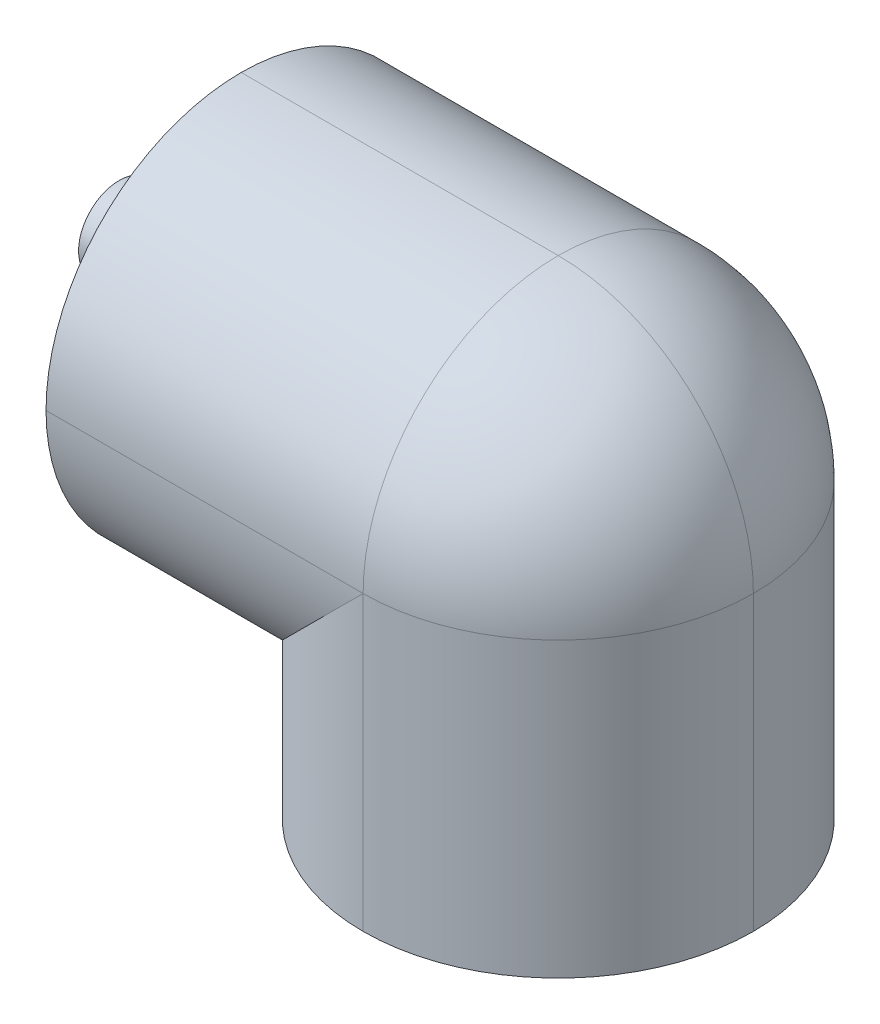
ISO-10303-21;
HEADER;
FILE_DESCRIPTION(('STEP AP214'),'2;1');
FILE_NAME('part.step','',(''),(''),'','','');
FILE_SCHEMA(('AUTOMOTIVE_DESIGN { 1 0 10303 214 1 1 1 1 }'));
ENDSEC;
DATA;
#1=APPLICATION_CONTEXT('core data for automotive mechanical design processes');
#2=APPLICATION_PROTOCOL_DEFINITION('international standard','automotive_design',2000,#1);
#3=PRODUCT_CONTEXT('',#1,'mechanical');
#4=PRODUCT('Part','Part','',(#3));
#5=PRODUCT_RELATED_PRODUCT_CATEGORY('part','',(#4));
#6=PRODUCT_DEFINITION_FORMATION('','',#4);
#7=PRODUCT_DEFINITION_CONTEXT('part definition',#1,'design');
#8=PRODUCT_DEFINITION('design','',#6,#7);
#9=PRODUCT_DEFINITION_SHAPE('','',#8);
#10=(LENGTH_UNIT() NAMED_UNIT(*) SI_UNIT(.MILLI.,.METRE.));
#11=(NAMED_UNIT(*) PLANE_ANGLE_UNIT() SI_UNIT($,.RADIAN.));
#12=(NAMED_UNIT(*) SI_UNIT($,.STERADIAN.) SOLID_ANGLE_UNIT());
#13=UNCERTAINTY_MEASURE_WITH_UNIT(LENGTH_MEASURE(1.E-05),#10,'distance_accuracy_value','');
#14=(GEOMETRIC_REPRESENTATION_CONTEXT(3) GLOBAL_UNCERTAINTY_ASSIGNED_CONTEXT((#13)) GLOBAL_UNIT_ASSIGNED_CONTEXT((#10,
#11,#12)) REPRESENTATION_CONTEXT('',''));
#15=CARTESIAN_POINT('',(0.,0.,0.));
#16=DIRECTION('',(0.,0.,1.));
#17=DIRECTION('',(1.,0.,0.));
#18=AXIS2_PLACEMENT_3D('',#15,#16,#17);
#19=CARTESIAN_POINT('',(0.,-30.,0.));
#20=DIRECTION('',(0.,-1.,0.));
#21=DIRECTION('',(0.,0.,-1.));
#22=AXIS2_PLACEMENT_3D('',#19,#20,#21);
#23=PLANE('',#22);
#24=CARTESIAN_POINT('',(24.,-30.,-24.));
#25=DIRECTION('',(0.,-1.,0.));
#26=DIRECTION('',(0.,0.,-1.));
#27=AXIS2_PLACEMENT_3D('',#24,#25,#26);
#28=CIRCLE('',#27,5.);
#29=CARTESIAN_POINT('',(24.,-30.,-29.));
#30=VERTEX_POINT('',#29);
#31=EDGE_CURVE('E164',#30,#30,#28,.T.);
#32=ORIENTED_EDGE('',*,*,#31,.F.);
#33=EDGE_LOOP('',(#32));
#34=FACE_BOUND('',#33,.T.);
#35=CARTESIAN_POINT('',(24.,-30.,-24.));
#36=DIRECTION('',(0.,-1.,0.));
#37=DIRECTION('',(0.,0.,-1.));
#38=AXIS2_PLACEMENT_3D('',#35,#36,#37);
#39=CIRCLE('',#38,24.);
#40=CARTESIAN_POINT('',(0.,-30.,-24.));
#41=VERTEX_POINT('',#40);
#42=CARTESIAN_POINT('',(24.,-30.,-48.));
#43=VERTEX_POINT('',#42);
#44=EDGE_CURVE('E100',#41,#43,#39,.T.);
#45=ORIENTED_EDGE('',*,*,#44,.T.);
#46=CARTESIAN_POINT('',(24.,-30.,-24.));
#47=DIRECTION('',(0.,-1.,0.));
#48=DIRECTION('',(0.,0.,-1.));
#49=AXIS2_PLACEMENT_3D('',#46,#47,#48);
#50=CIRCLE('',#49,24.);
#51=CARTESIAN_POINT('',(48.,-30.,-24.));
#52=VERTEX_POINT('',#51);
#53=EDGE_CURVE('E47',#43,#52,#50,.T.);
#54=ORIENTED_EDGE('',*,*,#53,.T.);
#55=CARTESIAN_POINT('',(24.,-30.,-24.));
#56=DIRECTION('',(0.,-1.,0.));
#57=DIRECTION('',(0.,0.,-1.));
#58=AXIS2_PLACEMENT_3D('',#55,#56,#57);
#59=CIRCLE('',#58,24.);
#60=CARTESIAN_POINT('',(24.,-30.,0.));
#61=VERTEX_POINT('',#60);
#62=EDGE_CURVE('E56',#52,#61,#59,.T.);
#63=ORIENTED_EDGE('',*,*,#62,.T.);
#64=CARTESIAN_POINT('',(24.,-30.,-24.));
#65=DIRECTION('',(0.,-1.,0.));
#66=DIRECTION('',(0.,0.,-1.));
#67=AXIS2_PLACEMENT_3D('',#64,#65,#66);
#68=CIRCLE('',#67,24.);
#69=EDGE_CURVE('E103',#61,#41,#68,.T.);
#70=ORIENTED_EDGE('',*,*,#69,.T.);
#71=EDGE_LOOP('',(#45,#54,#63,#70));
#72=FACE_BOUND('',#71,.T.);
#73=ADVANCED_FACE('F37',(#34,#72),#23,.T.);
#74=CARTESIAN_POINT('',(-15.,0.,0.));
#75=DIRECTION('',(-1.,0.,0.));
#76=DIRECTION('',(0.,0.,1.));
#77=AXIS2_PLACEMENT_3D('',#74,#75,#76);
#78=PLANE('',#77);
#79=CARTESIAN_POINT('',(-15.,6.,-24.));
#80=DIRECTION('',(-1.,0.,0.));
#81=DIRECTION('',(0.,0.,1.));
#82=AXIS2_PLACEMENT_3D('',#79,#80,#81);
#83=CIRCLE('',#82,5.);
#84=CARTESIAN_POINT('',(-15.,6.,-19.));
#85=VERTEX_POINT('',#84);
#86=EDGE_CURVE('E11',#85,#85,#83,.T.);
#87=ORIENTED_EDGE('',*,*,#86,.F.);
#88=EDGE_LOOP('',(#87));
#89=FACE_BOUND('',#88,.T.);
#90=CARTESIAN_POINT('',(-15.,6.,-24.));
#91=DIRECTION('',(-1.,0.,0.));
#92=DIRECTION('',(0.,0.,1.));
#93=AXIS2_PLACEMENT_3D('',#90,#91,#92);
#94=CIRCLE('',#93,24.);
#95=CARTESIAN_POINT('',(-15.,6.,-48.));
#96=VERTEX_POINT('',#95);
#97=CARTESIAN_POINT('',(-15.,-18.,-24.));
#98=VERTEX_POINT('',#97);
#99=EDGE_CURVE('E161',#96,#98,#94,.T.);
#100=ORIENTED_EDGE('',*,*,#99,.T.);
#101=CARTESIAN_POINT('',(-15.,6.,-24.));
#102=DIRECTION('',(-1.,0.,0.));
#103=DIRECTION('',(0.,0.,1.));
#104=AXIS2_PLACEMENT_3D('',#101,#102,#103);
#105=CIRCLE('',#104,24.);
#106=CARTESIAN_POINT('',(-15.,6.,0.));
#107=VERTEX_POINT('',#106);
#108=EDGE_CURVE('E106',#98,#107,#105,.T.);
#109=ORIENTED_EDGE('',*,*,#108,.T.);
#110=CARTESIAN_POINT('',(-15.,6.,-24.));
#111=DIRECTION('',(-1.,0.,0.));
#112=DIRECTION('',(0.,0.,1.));
#113=AXIS2_PLACEMENT_3D('',#110,#111,#112);
#114=CIRCLE('',#113,24.);
#115=CARTESIAN_POINT('',(-15.,30.,-24.));
#116=VERTEX_POINT('',#115);
#117=EDGE_CURVE('E157',#107,#116,#114,.T.);
#118=ORIENTED_EDGE('',*,*,#117,.T.);
#119=CARTESIAN_POINT('',(-15.,6.,-24.));
#120=DIRECTION('',(-1.,0.,0.));
#121=DIRECTION('',(0.,0.,1.));
#122=AXIS2_PLACEMENT_3D('',#119,#120,#121);
#123=CIRCLE('',#122,24.);
#124=EDGE_CURVE('E88',#116,#96,#123,.T.);
#125=ORIENTED_EDGE('',*,*,#124,.T.);
#126=EDGE_LOOP('',(#100,#109,#118,#125));
#127=FACE_BOUND('',#126,.T.);
#128=ADVANCED_FACE('F169',(#89,#127),#78,.T.);
#129=CARTESIAN_POINT('',(24.,30.,-24.));
#130=DIRECTION('',(0.,-1.,0.));
#131=DIRECTION('',(0.,0.,-1.));
#132=AXIS2_PLACEMENT_3D('',#129,#130,#131);
#133=CYLINDRICAL_SURFACE('',#132,24.);
#134=CARTESIAN_POINT('',(24.,6.,-24.));
#135=DIRECTION('',(0.707106781186547,-0.707106781186547,0.));
#136=DIRECTION('',(0.707106781186547,0.707106781186547,0.));
#137=AXIS2_PLACEMENT_3D('',#134,#135,#136);
#138=ELLIPSE('',#137,33.9411254969543,24.);
#139=CARTESIAN_POINT('',(0.,-18.,-24.));
#140=VERTEX_POINT('',#139);
#141=CARTESIAN_POINT('',(24.,6.,0.));
#142=VERTEX_POINT('',#141);
#143=EDGE_CURVE('E41',#140,#142,#138,.F.);
#144=ORIENTED_EDGE('',*,*,#143,.F.);
#145=DIRECTION('',(0.,-1.,0.));
#146=VECTOR('',#145,1.);
#147=CARTESIAN_POINT('',(0.,30.,-24.));
#148=LINE('',#147,#146);
#149=EDGE_CURVE('E152',#41,#140,#148,.F.);
#150=ORIENTED_EDGE('',*,*,#149,.F.);
#151=ORIENTED_EDGE('',*,*,#69,.F.);
#152=DIRECTION('',(0.,-1.,0.));
#153=VECTOR('',#152,1.);
#154=CARTESIAN_POINT('',(24.,30.,0.));
#155=LINE('',#154,#153);
#156=EDGE_CURVE('E149',#142,#61,#155,.T.);
#157=ORIENTED_EDGE('',*,*,#156,.F.);
#158=EDGE_LOOP('',(#144,#150,#151,#157));
#159=FACE_BOUND('',#158,.T.);
#160=ADVANCED_FACE('F39',(#159),#133,.T.);
#161=CARTESIAN_POINT('',(0.,6.,-24.));
#162=DIRECTION('',(1.,0.,0.));
#163=DIRECTION('',(0.,0.,-1.));
#164=AXIS2_PLACEMENT_3D('',#161,#162,#163);
#165=CYLINDRICAL_SURFACE('',#164,24.);
#166=DIRECTION('',(1.,0.,0.));
#167=VECTOR('',#166,1.);
#168=CARTESIAN_POINT('',(0.,6.,0.));
#169=LINE('',#168,#167);
#170=EDGE_CURVE('E146',#107,#142,#169,.T.);
#171=ORIENTED_EDGE('',*,*,#170,.F.);
#172=ORIENTED_EDGE('',*,*,#108,.F.);
#173=DIRECTION('',(1.,0.,0.));
#174=VECTOR('',#173,1.);
#175=CARTESIAN_POINT('',(-15.,-18.,-24.));
#176=LINE('',#175,#174);
#177=EDGE_CURVE('E154',#140,#98,#176,.F.);
#178=ORIENTED_EDGE('',*,*,#177,.F.);
#179=ORIENTED_EDGE('',*,*,#143,.T.);
#180=EDGE_LOOP('',(#171,#172,#178,#179));
#181=FACE_BOUND('',#180,.T.);
#182=ADVANCED_FACE('F170',(#181),#165,.T.);
#183=CARTESIAN_POINT('',(-15.,6.,-24.));
#184=DIRECTION('',(1.,0.,0.));
#185=DIRECTION('',(0.,0.,-1.));
#186=AXIS2_PLACEMENT_3D('',#183,#184,#185);
#187=CYLINDRICAL_SURFACE('',#186,24.);
#188=CARTESIAN_POINT('',(24.,6.,-24.));
#189=DIRECTION('',(0.707106781186547,-0.707106781186547,0.));
#190=DIRECTION('',(0.707106781186547,0.707106781186547,0.));
#191=AXIS2_PLACEMENT_3D('',#188,#189,#190);
#192=ELLIPSE('',#191,33.9411254969543,24.);
#193=CARTESIAN_POINT('',(24.,6.,-48.));
#194=VERTEX_POINT('',#193);
#195=EDGE_CURVE('E112',#140,#194,#192,.T.);
#196=ORIENTED_EDGE('',*,*,#195,.F.);
#197=ORIENTED_EDGE('',*,*,#177,.T.);
#198=ORIENTED_EDGE('',*,*,#99,.F.);
#199=DIRECTION('',(1.,0.,0.));
#200=VECTOR('',#199,1.);
#201=CARTESIAN_POINT('',(0.,6.,-48.));
#202=LINE('',#201,#200);
#203=EDGE_CURVE('E117',#194,#96,#202,.F.);
#204=ORIENTED_EDGE('',*,*,#203,.F.);
#205=EDGE_LOOP('',(#196,#197,#198,#204));
#206=FACE_BOUND('',#205,.T.);
#207=ADVANCED_FACE('F184',(#206),#187,.T.);
#208=CARTESIAN_POINT('',(24.,30.,-24.));
#209=DIRECTION('',(0.,-1.,0.));
#210=DIRECTION('',(0.,0.,-1.));
#211=AXIS2_PLACEMENT_3D('',#208,#209,#210);
#212=CYLINDRICAL_SURFACE('',#211,24.);
#213=ORIENTED_EDGE('',*,*,#149,.T.);
#214=ORIENTED_EDGE('',*,*,#195,.T.);
#215=DIRECTION('',(0.,-1.,0.));
#216=VECTOR('',#215,1.);
#217=CARTESIAN_POINT('',(24.,30.,-48.));
#218=LINE('',#217,#216);
#219=EDGE_CURVE('E109',#43,#194,#218,.F.);
#220=ORIENTED_EDGE('',*,*,#219,.F.);
#221=ORIENTED_EDGE('',*,*,#44,.F.);
#222=EDGE_LOOP('',(#213,#214,#220,#221));
#223=FACE_BOUND('',#222,.T.);
#224=ADVANCED_FACE('F110',(#223),#212,.T.);
#225=CARTESIAN_POINT('',(24.,30.,-24.));
#226=DIRECTION('',(0.,-1.,0.));
#227=DIRECTION('',(0.,0.,-1.));
#228=AXIS2_PLACEMENT_3D('',#225,#226,#227);
#229=CYLINDRICAL_SURFACE('',#228,24.);
#230=ORIENTED_EDGE('',*,*,#156,.T.);
#231=ORIENTED_EDGE('',*,*,#62,.F.);
#232=DIRECTION('',(0.,-1.,0.));
#233=VECTOR('',#232,1.);
#234=CARTESIAN_POINT('',(48.,30.,-24.));
#235=LINE('',#234,#233);
#236=CARTESIAN_POINT('',(48.,6.,-24.));
#237=VERTEX_POINT('',#236);
#238=EDGE_CURVE('E118',#237,#52,#235,.T.);
#239=ORIENTED_EDGE('',*,*,#238,.F.);
#240=CARTESIAN_POINT('',(24.,6.,-24.));
#241=DIRECTION('',(0.,1.,0.));
#242=DIRECTION('',(0.,0.,1.));
#243=AXIS2_PLACEMENT_3D('',#240,#241,#242);
#244=CIRCLE('',#243,24.);
#245=EDGE_CURVE('E138',#142,#237,#244,.T.);
#246=ORIENTED_EDGE('',*,*,#245,.F.);
#247=EDGE_LOOP('',(#230,#231,#239,#246));
#248=FACE_BOUND('',#247,.T.);
#249=ADVANCED_FACE('F176',(#248),#229,.T.);
#250=CARTESIAN_POINT('',(0.,6.,-24.));
#251=DIRECTION('',(1.,0.,0.));
#252=DIRECTION('',(0.,0.,-1.));
#253=AXIS2_PLACEMENT_3D('',#250,#251,#252);
#254=CYLINDRICAL_SURFACE('',#253,24.);
#255=DIRECTION('',(1.,0.,0.));
#256=VECTOR('',#255,1.);
#257=CARTESIAN_POINT('',(0.,30.,-24.));
#258=LINE('',#257,#256);
#259=CARTESIAN_POINT('',(24.,30.,-24.));
#260=VERTEX_POINT('',#259);
#261=EDGE_CURVE('E144',#116,#260,#258,.T.);
#262=ORIENTED_EDGE('',*,*,#261,.F.);
#263=ORIENTED_EDGE('',*,*,#117,.F.);
#264=ORIENTED_EDGE('',*,*,#170,.T.);
#265=CARTESIAN_POINT('',(24.,6.,-24.));
#266=DIRECTION('',(1.,0.,0.));
#267=DIRECTION('',(0.,0.,-1.));
#268=AXIS2_PLACEMENT_3D('',#265,#266,#267);
#269=CIRCLE('',#268,24.);
#270=EDGE_CURVE('E135',#260,#142,#269,.T.);
#271=ORIENTED_EDGE('',*,*,#270,.F.);
#272=EDGE_LOOP('',(#262,#263,#264,#271));
#273=FACE_BOUND('',#272,.T.);
#274=ADVANCED_FACE('F174',(#273),#254,.T.);
#275=CARTESIAN_POINT('',(0.,6.,-24.));
#276=DIRECTION('',(-1.,0.,0.));
#277=DIRECTION('',(0.,0.,1.));
#278=AXIS2_PLACEMENT_3D('',#275,#276,#277);
#279=CYLINDRICAL_SURFACE('',#278,24.);
#280=ORIENTED_EDGE('',*,*,#124,.F.);
#281=ORIENTED_EDGE('',*,*,#261,.T.);
#282=CARTESIAN_POINT('',(24.,6.,-24.));
#283=DIRECTION('',(1.,0.,0.));
#284=DIRECTION('',(0.,0.,-1.));
#285=AXIS2_PLACEMENT_3D('',#282,#283,#284);
#286=CIRCLE('',#285,24.);
#287=EDGE_CURVE('E132',#194,#260,#286,.T.);
#288=ORIENTED_EDGE('',*,*,#287,.F.);
#289=ORIENTED_EDGE('',*,*,#203,.T.);
#290=EDGE_LOOP('',(#280,#281,#288,#289));
#291=FACE_BOUND('',#290,.T.);
#292=ADVANCED_FACE('F183',(#291),#279,.T.);
#293=CARTESIAN_POINT('',(24.,30.,-24.));
#294=DIRECTION('',(0.,-1.,0.));
#295=DIRECTION('',(0.,0.,-1.));
#296=AXIS2_PLACEMENT_3D('',#293,#294,#295);
#297=CYLINDRICAL_SURFACE('',#296,24.);
#298=ORIENTED_EDGE('',*,*,#53,.F.);
#299=ORIENTED_EDGE('',*,*,#219,.T.);
#300=CARTESIAN_POINT('',(24.,6.,-24.));
#301=DIRECTION('',(0.,1.,0.));
#302=DIRECTION('',(0.,0.,1.));
#303=AXIS2_PLACEMENT_3D('',#300,#301,#302);
#304=CIRCLE('',#303,24.);
#305=EDGE_CURVE('E128',#237,#194,#304,.T.);
#306=ORIENTED_EDGE('',*,*,#305,.F.);
#307=ORIENTED_EDGE('',*,*,#238,.T.);
#308=EDGE_LOOP('',(#298,#299,#306,#307));
#309=FACE_BOUND('',#308,.T.);
#310=ADVANCED_FACE('F120',(#309),#297,.T.);
#311=CARTESIAN_POINT('',(24.,6.,-24.));
#312=DIRECTION('',(0.,0.,1.));
#313=DIRECTION('',(1.,0.,0.));
#314=AXIS2_PLACEMENT_3D('',#311,#312,#313);
#315=SPHERICAL_SURFACE('',#314,24.);
#316=ORIENTED_EDGE('',*,*,#270,.T.);
#317=ORIENTED_EDGE('',*,*,#245,.T.);
#318=CARTESIAN_POINT('',(24.,6.,-24.));
#319=DIRECTION('',(0.,0.,1.));
#320=DIRECTION('',(1.,0.,0.));
#321=AXIS2_PLACEMENT_3D('',#318,#319,#320);
#322=CIRCLE('',#321,24.);
#323=EDGE_CURVE('E125',#260,#237,#322,.F.);
#324=ORIENTED_EDGE('',*,*,#323,.F.);
#325=EDGE_LOOP('',(#316,#317,#324));
#326=FACE_BOUND('',#325,.T.);
#327=ADVANCED_FACE('F179',(#326),#315,.T.);
#328=CARTESIAN_POINT('',(24.,6.,-24.));
#329=DIRECTION('',(0.,0.,-1.));
#330=DIRECTION('',(-1.,0.,0.));
#331=AXIS2_PLACEMENT_3D('',#328,#329,#330);
#332=SPHERICAL_SURFACE('',#331,24.);
#333=ORIENTED_EDGE('',*,*,#305,.T.);
#334=ORIENTED_EDGE('',*,*,#287,.T.);
#335=ORIENTED_EDGE('',*,*,#323,.T.);
#336=EDGE_LOOP('',(#333,#334,#335));
#337=FACE_BOUND('',#336,.T.);
#338=ADVANCED_FACE('F181',(#337),#332,.T.);
#339=CARTESIAN_POINT('',(24.,-15.,-24.));
#340=DIRECTION('',(0.,-1.,0.));
#341=DIRECTION('',(0.,0.,-1.));
#342=AXIS2_PLACEMENT_3D('',#339,#340,#341);
#343=CYLINDRICAL_SURFACE('',#342,5.);
#344=CARTESIAN_POINT('',(24.,-15.,-24.));
#345=DIRECTION('',(0.,-1.,0.));
#346=DIRECTION('',(0.,0.,-1.));
#347=AXIS2_PLACEMENT_3D('',#344,#345,#346);
#348=CIRCLE('',#347,5.);
#349=CARTESIAN_POINT('',(24.,-15.,-29.));
#350=VERTEX_POINT('',#349);
#351=EDGE_CURVE('E129',#350,#350,#348,.T.);
#352=ORIENTED_EDGE('',*,*,#351,.F.);
#353=EDGE_LOOP('',(#352));
#354=FACE_BOUND('',#353,.T.);
#355=ORIENTED_EDGE('',*,*,#31,.T.);
#356=EDGE_LOOP('',(#355));
#357=FACE_BOUND('',#356,.T.);
#358=ADVANCED_FACE('F202',(#354,#357),#343,.F.);
#359=CARTESIAN_POINT('',(24.,-15.,-24.));
#360=DIRECTION('',(0.,-1.,0.));
#361=DIRECTION('',(0.,0.,-1.));
#362=AXIS2_PLACEMENT_3D('',#359,#360,#361);
#363=PLANE('',#362);
#364=ORIENTED_EDGE('',*,*,#351,.T.);
#365=EDGE_LOOP('',(#364));
#366=FACE_BOUND('',#365,.T.);
#367=ADVANCED_FACE('F254',(#366),#363,.T.);
#368=CARTESIAN_POINT('',(-30.,6.,-24.));
#369=DIRECTION('',(1.,0.,0.));
#370=DIRECTION('',(0.,0.,-1.));
#371=AXIS2_PLACEMENT_3D('',#368,#369,#370);
#372=CYLINDRICAL_SURFACE('',#371,5.);
#373=CARTESIAN_POINT('',(-30.,6.,-24.));
#374=DIRECTION('',(-1.,0.,0.));
#375=DIRECTION('',(0.,0.,1.));
#376=AXIS2_PLACEMENT_3D('',#373,#374,#375);
#377=CIRCLE('',#376,5.);
#378=CARTESIAN_POINT('',(-30.,6.,-19.));
#379=VERTEX_POINT('',#378);
#380=EDGE_CURVE('E356',#379,#379,#377,.T.);
#381=ORIENTED_EDGE('',*,*,#380,.F.);
#382=EDGE_LOOP('',(#381));
#383=FACE_BOUND('',#382,.T.);
#384=ORIENTED_EDGE('',*,*,#86,.T.);
#385=EDGE_LOOP('',(#384));
#386=FACE_BOUND('',#385,.T.);
#387=ADVANCED_FACE('F261',(#383,#386),#372,.T.);
#388=CARTESIAN_POINT('',(-30.,6.,-24.));
#389=DIRECTION('',(-1.,0.,0.));
#390=DIRECTION('',(0.,0.,1.));
#391=AXIS2_PLACEMENT_3D('',#388,#389,#390);
#392=PLANE('',#391);
#393=ORIENTED_EDGE('',*,*,#380,.T.);
#394=EDGE_LOOP('',(#393));
#395=FACE_BOUND('',#394,.T.);
#396=ADVANCED_FACE('F270',(#395),#392,.T.);
#397=CLOSED_SHELL('',(#73,#128,#160,#182,#207,#224,#249,#274,#292,#310,#327,#338,#358,#367,#387,#396));
#398=MANIFOLD_SOLID_BREP('B2',#397);
#399=ADVANCED_BREP_SHAPE_REPRESENTATION('',(#18,#398),#14);
#400=SHAPE_DEFINITION_REPRESENTATION(#9,#399);
ENDSEC;
END-ISO-10303-21;
